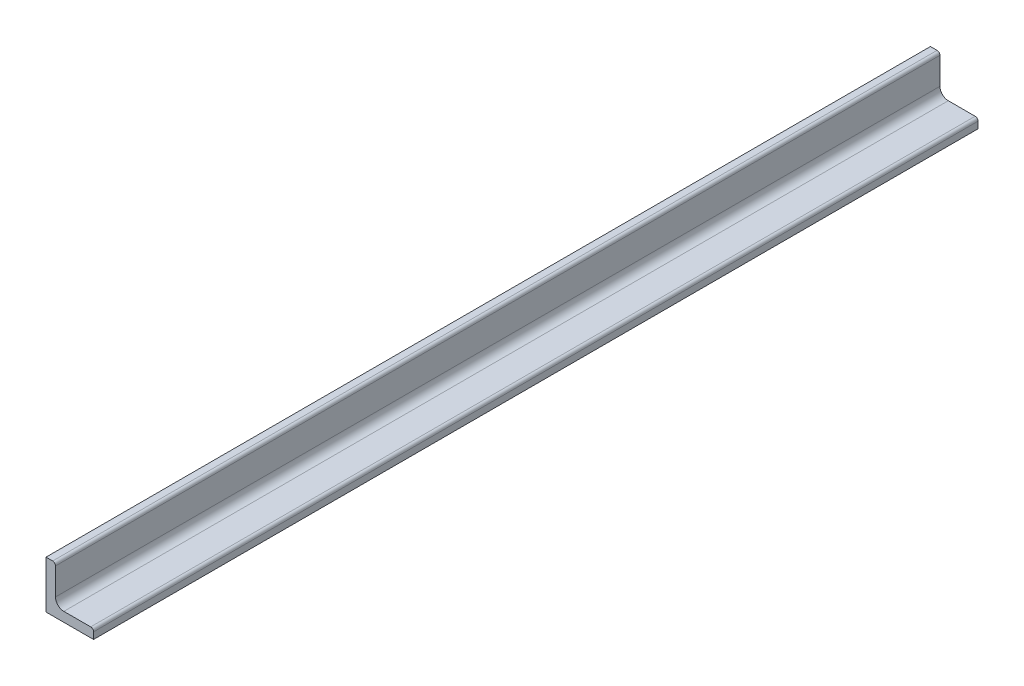
ISO-10303-21;
HEADER;
FILE_DESCRIPTION(('STEP AP214'),'2;1');
FILE_NAME('part.step','',(''),(''),'','','');
FILE_SCHEMA(('AUTOMOTIVE_DESIGN { 1 0 10303 214 1 1 1 1 }'));
ENDSEC;
DATA;
#1=APPLICATION_CONTEXT('core data for automotive mechanical design processes');
#2=APPLICATION_PROTOCOL_DEFINITION('international standard','automotive_design',2000,#1);
#3=PRODUCT_CONTEXT('',#1,'mechanical');
#4=PRODUCT('Part','Part','',(#3));
#5=PRODUCT_RELATED_PRODUCT_CATEGORY('part','',(#4));
#6=PRODUCT_DEFINITION_FORMATION('','',#4);
#7=PRODUCT_DEFINITION_CONTEXT('part definition',#1,'design');
#8=PRODUCT_DEFINITION('design','',#6,#7);
#9=PRODUCT_DEFINITION_SHAPE('','',#8);
#10=(LENGTH_UNIT() NAMED_UNIT(*) SI_UNIT(.MILLI.,.METRE.));
#11=(NAMED_UNIT(*) PLANE_ANGLE_UNIT() SI_UNIT($,.RADIAN.));
#12=(NAMED_UNIT(*) SI_UNIT($,.STERADIAN.) SOLID_ANGLE_UNIT());
#13=UNCERTAINTY_MEASURE_WITH_UNIT(LENGTH_MEASURE(1.E-05),#10,'distance_accuracy_value','');
#14=(GEOMETRIC_REPRESENTATION_CONTEXT(3) GLOBAL_UNCERTAINTY_ASSIGNED_CONTEXT((#13)) GLOBAL_UNIT_ASSIGNED_CONTEXT((#10,
#11,#12)) REPRESENTATION_CONTEXT('',''));
#15=CARTESIAN_POINT('',(0.,0.,0.));
#16=DIRECTION('',(0.,0.,1.));
#17=DIRECTION('',(1.,0.,0.));
#18=AXIS2_PLACEMENT_3D('',#15,#16,#17);
#19=CARTESIAN_POINT('',(-4.7,12.5,372.));
#20=DIRECTION('',(0.,-1.,0.));
#21=DIRECTION('',(0.,0.,-1.));
#22=AXIS2_PLACEMENT_3D('',#19,#20,#21);
#23=PLANE('',#22);
#24=DIRECTION('',(-1.,0.,0.));
#25=VECTOR('',#24,1.);
#26=CARTESIAN_POINT('',(-4.7,12.5,0.));
#27=LINE('',#26,#25);
#28=CARTESIAN_POINT('',(-4.7,12.5,0.));
#29=VERTEX_POINT('',#28);
#30=CARTESIAN_POINT('',(-7.5,12.5,0.));
#31=VERTEX_POINT('',#30);
#32=EDGE_CURVE('E137',#29,#31,#27,.T.);
#33=ORIENTED_EDGE('',*,*,#32,.T.);
#34=DIRECTION('',(0.,0.,-1.));
#35=VECTOR('',#34,1.);
#36=CARTESIAN_POINT('',(-7.5,12.5,372.));
#37=LINE('',#36,#35);
#38=CARTESIAN_POINT('',(-7.5,12.5,372.));
#39=VERTEX_POINT('',#38);
#40=EDGE_CURVE('E11',#39,#31,#37,.T.);
#41=ORIENTED_EDGE('',*,*,#40,.F.);
#42=DIRECTION('',(-1.,0.,0.));
#43=VECTOR('',#42,1.);
#44=CARTESIAN_POINT('',(-4.7,12.5,372.));
#45=LINE('',#44,#43);
#46=CARTESIAN_POINT('',(-4.7,12.5,372.));
#47=VERTEX_POINT('',#46);
#48=EDGE_CURVE('E153',#47,#39,#45,.T.);
#49=ORIENTED_EDGE('',*,*,#48,.F.);
#50=DIRECTION('',(0.,0.,-1.));
#51=VECTOR('',#50,1.);
#52=CARTESIAN_POINT('',(-4.7,12.5,372.));
#53=LINE('',#52,#51);
#54=EDGE_CURVE('E133',#47,#29,#53,.T.);
#55=ORIENTED_EDGE('',*,*,#54,.T.);
#56=EDGE_LOOP('',(#33,#41,#49,#55));
#57=FACE_BOUND('',#56,.T.);
#58=ADVANCED_FACE('F35',(#57),#23,.F.);
#59=CARTESIAN_POINT('',(-7.5,12.5,372.));
#60=DIRECTION('',(1.,0.,0.));
#61=DIRECTION('',(0.,1.,0.));
#62=AXIS2_PLACEMENT_3D('',#59,#60,#61);
#63=PLANE('',#62);
#64=DIRECTION('',(0.,-1.,0.));
#65=VECTOR('',#64,1.);
#66=CARTESIAN_POINT('',(-7.5,12.5,0.));
#67=LINE('',#66,#65);
#68=CARTESIAN_POINT('',(-7.49999999999999,-7.49999999999999,0.));
#69=VERTEX_POINT('',#68);
#70=EDGE_CURVE('E140',#31,#69,#67,.T.);
#71=ORIENTED_EDGE('',*,*,#70,.T.);
#72=DIRECTION('',(0.,0.,-1.));
#73=VECTOR('',#72,1.);
#74=CARTESIAN_POINT('',(-7.49999999999999,-7.49999999999999,372.));
#75=LINE('',#74,#73);
#76=CARTESIAN_POINT('',(-7.49999999999999,-7.49999999999999,372.));
#77=VERTEX_POINT('',#76);
#78=EDGE_CURVE('E43',#77,#69,#75,.T.);
#79=ORIENTED_EDGE('',*,*,#78,.F.);
#80=DIRECTION('',(0.,-1.,0.));
#81=VECTOR('',#80,1.);
#82=CARTESIAN_POINT('',(-7.5,12.5,372.));
#83=LINE('',#82,#81);
#84=EDGE_CURVE('E97',#39,#77,#83,.T.);
#85=ORIENTED_EDGE('',*,*,#84,.F.);
#86=ORIENTED_EDGE('',*,*,#40,.T.);
#87=EDGE_LOOP('',(#71,#79,#85,#86));
#88=FACE_BOUND('',#87,.T.);
#89=ADVANCED_FACE('F196',(#88),#63,.F.);
#90=CARTESIAN_POINT('',(-7.49999999999999,-7.49999999999999,372.));
#91=DIRECTION('',(0.,1.,0.));
#92=DIRECTION('',(-1.,0.,0.));
#93=AXIS2_PLACEMENT_3D('',#90,#91,#92);
#94=PLANE('',#93);
#95=DIRECTION('',(1.,0.,0.));
#96=VECTOR('',#95,1.);
#97=CARTESIAN_POINT('',(-7.49999999999999,-7.49999999999999,0.));
#98=LINE('',#97,#96);
#99=CARTESIAN_POINT('',(12.5,-7.5,0.));
#100=VERTEX_POINT('',#99);
#101=EDGE_CURVE('E142',#69,#100,#98,.T.);
#102=ORIENTED_EDGE('',*,*,#101,.T.);
#103=DIRECTION('',(0.,0.,-1.));
#104=VECTOR('',#103,1.);
#105=CARTESIAN_POINT('',(12.5,-7.5,372.));
#106=LINE('',#105,#104);
#107=CARTESIAN_POINT('',(12.5,-7.5,372.));
#108=VERTEX_POINT('',#107);
#109=EDGE_CURVE('E163',#108,#100,#106,.T.);
#110=ORIENTED_EDGE('',*,*,#109,.F.);
#111=DIRECTION('',(1.,0.,0.));
#112=VECTOR('',#111,1.);
#113=CARTESIAN_POINT('',(-7.49999999999999,-7.49999999999999,372.));
#114=LINE('',#113,#112);
#115=EDGE_CURVE('E171',#77,#108,#114,.T.);
#116=ORIENTED_EDGE('',*,*,#115,.F.);
#117=ORIENTED_EDGE('',*,*,#78,.T.);
#118=EDGE_LOOP('',(#102,#110,#116,#117));
#119=FACE_BOUND('',#118,.T.);
#120=ADVANCED_FACE('F169',(#119),#94,.F.);
#121=CARTESIAN_POINT('',(12.5,-7.5,372.));
#122=DIRECTION('',(-1.,0.,0.));
#123=DIRECTION('',(0.,-1.,0.));
#124=AXIS2_PLACEMENT_3D('',#121,#122,#123);
#125=PLANE('',#124);
#126=DIRECTION('',(0.,1.,0.));
#127=VECTOR('',#126,1.);
#128=CARTESIAN_POINT('',(12.5,-7.5,0.));
#129=LINE('',#128,#127);
#130=CARTESIAN_POINT('',(12.5,-4.7,0.));
#131=VERTEX_POINT('',#130);
#132=EDGE_CURVE('E144',#100,#131,#129,.T.);
#133=ORIENTED_EDGE('',*,*,#132,.T.);
#134=DIRECTION('',(0.,0.,-1.));
#135=VECTOR('',#134,1.);
#136=CARTESIAN_POINT('',(12.5,-4.7,372.));
#137=LINE('',#136,#135);
#138=CARTESIAN_POINT('',(12.5,-4.7,372.));
#139=VERTEX_POINT('',#138);
#140=EDGE_CURVE('E160',#139,#131,#137,.T.);
#141=ORIENTED_EDGE('',*,*,#140,.F.);
#142=DIRECTION('',(0.,1.,0.));
#143=VECTOR('',#142,1.);
#144=CARTESIAN_POINT('',(12.5,-7.5,372.));
#145=LINE('',#144,#143);
#146=EDGE_CURVE('E187',#108,#139,#145,.T.);
#147=ORIENTED_EDGE('',*,*,#146,.F.);
#148=ORIENTED_EDGE('',*,*,#109,.T.);
#149=EDGE_LOOP('',(#133,#141,#147,#148));
#150=FACE_BOUND('',#149,.T.);
#151=ADVANCED_FACE('F180',(#150),#125,.F.);
#152=CARTESIAN_POINT('',(11.3,-4.7,372.));
#153=DIRECTION('',(0.,0.,-1.));
#154=DIRECTION('',(-1.,0.,0.));
#155=AXIS2_PLACEMENT_3D('',#152,#153,#154);
#156=CYLINDRICAL_SURFACE('',#155,1.2);
#157=CARTESIAN_POINT('',(11.3,-4.7,0.));
#158=DIRECTION('',(0.,0.,1.));
#159=DIRECTION('',(1.,0.,0.));
#160=AXIS2_PLACEMENT_3D('',#157,#158,#159);
#161=CIRCLE('',#160,1.2);
#162=CARTESIAN_POINT('',(11.3,-3.5,0.));
#163=VERTEX_POINT('',#162);
#164=EDGE_CURVE('E146',#131,#163,#161,.T.);
#165=ORIENTED_EDGE('',*,*,#164,.T.);
#166=DIRECTION('',(0.,0.,-1.));
#167=VECTOR('',#166,1.);
#168=CARTESIAN_POINT('',(11.3,-3.5,372.));
#169=LINE('',#168,#167);
#170=CARTESIAN_POINT('',(11.3,-3.5,372.));
#171=VERTEX_POINT('',#170);
#172=EDGE_CURVE('E157',#171,#163,#169,.T.);
#173=ORIENTED_EDGE('',*,*,#172,.F.);
#174=CARTESIAN_POINT('',(11.3,-4.7,372.));
#175=DIRECTION('',(0.,0.,1.));
#176=DIRECTION('',(1.,0.,0.));
#177=AXIS2_PLACEMENT_3D('',#174,#175,#176);
#178=CIRCLE('',#177,1.2);
#179=EDGE_CURVE('E186',#139,#171,#178,.T.);
#180=ORIENTED_EDGE('',*,*,#179,.F.);
#181=ORIENTED_EDGE('',*,*,#140,.T.);
#182=EDGE_LOOP('',(#165,#173,#180,#181));
#183=FACE_BOUND('',#182,.T.);
#184=ADVANCED_FACE('F184',(#183),#156,.T.);
#185=CARTESIAN_POINT('',(11.3,-3.5,372.));
#186=DIRECTION('',(0.,-1.,0.));
#187=DIRECTION('',(0.,0.,-1.));
#188=AXIS2_PLACEMENT_3D('',#185,#186,#187);
#189=PLANE('',#188);
#190=DIRECTION('',(-1.,0.,0.));
#191=VECTOR('',#190,1.);
#192=CARTESIAN_POINT('',(11.3,-3.5,0.));
#193=LINE('',#192,#191);
#194=CARTESIAN_POINT('',(0.,-3.5,0.));
#195=VERTEX_POINT('',#194);
#196=EDGE_CURVE('E148',#163,#195,#193,.T.);
#197=ORIENTED_EDGE('',*,*,#196,.T.);
#198=DIRECTION('',(0.,0.,-1.));
#199=VECTOR('',#198,1.);
#200=CARTESIAN_POINT('',(0.,-3.5,372.));
#201=LINE('',#200,#199);
#202=CARTESIAN_POINT('',(0.,-3.5,372.));
#203=VERTEX_POINT('',#202);
#204=EDGE_CURVE('E128',#203,#195,#201,.T.);
#205=ORIENTED_EDGE('',*,*,#204,.F.);
#206=DIRECTION('',(-1.,0.,0.));
#207=VECTOR('',#206,1.);
#208=CARTESIAN_POINT('',(11.3,-3.5,372.));
#209=LINE('',#208,#207);
#210=EDGE_CURVE('E119',#171,#203,#209,.T.);
#211=ORIENTED_EDGE('',*,*,#210,.F.);
#212=ORIENTED_EDGE('',*,*,#172,.T.);
#213=EDGE_LOOP('',(#197,#205,#211,#212));
#214=FACE_BOUND('',#213,.T.);
#215=ADVANCED_FACE('F208',(#214),#189,.F.);
#216=CARTESIAN_POINT('',(0.,0.,372.));
#217=DIRECTION('',(0.,0.,-1.));
#218=DIRECTION('',(-1.,0.,0.));
#219=AXIS2_PLACEMENT_3D('',#216,#217,#218);
#220=CYLINDRICAL_SURFACE('',#219,3.5);
#221=CARTESIAN_POINT('',(0.,0.,0.));
#222=DIRECTION('',(0.,0.,-1.));
#223=DIRECTION('',(1.,0.,0.));
#224=AXIS2_PLACEMENT_3D('',#221,#222,#223);
#225=CIRCLE('',#224,3.5);
#226=CARTESIAN_POINT('',(-3.5,0.,0.));
#227=VERTEX_POINT('',#226);
#228=EDGE_CURVE('E127',#195,#227,#225,.T.);
#229=ORIENTED_EDGE('',*,*,#228,.T.);
#230=DIRECTION('',(0.,0.,-1.));
#231=VECTOR('',#230,1.);
#232=CARTESIAN_POINT('',(-3.5,0.,372.));
#233=LINE('',#232,#231);
#234=CARTESIAN_POINT('',(-3.5,0.,372.));
#235=VERTEX_POINT('',#234);
#236=EDGE_CURVE('E124',#235,#227,#233,.T.);
#237=ORIENTED_EDGE('',*,*,#236,.F.);
#238=CARTESIAN_POINT('',(0.,0.,372.));
#239=DIRECTION('',(0.,0.,-1.));
#240=DIRECTION('',(1.,0.,0.));
#241=AXIS2_PLACEMENT_3D('',#238,#239,#240);
#242=CIRCLE('',#241,3.5);
#243=EDGE_CURVE('E113',#203,#235,#242,.T.);
#244=ORIENTED_EDGE('',*,*,#243,.F.);
#245=ORIENTED_EDGE('',*,*,#204,.T.);
#246=EDGE_LOOP('',(#229,#237,#244,#245));
#247=FACE_BOUND('',#246,.T.);
#248=ADVANCED_FACE('F125',(#247),#220,.F.);
#249=CARTESIAN_POINT('',(-3.5,0.,372.));
#250=DIRECTION('',(-1.,0.,0.));
#251=DIRECTION('',(0.,0.,1.));
#252=AXIS2_PLACEMENT_3D('',#249,#250,#251);
#253=PLANE('',#252);
#254=DIRECTION('',(0.,1.,0.));
#255=VECTOR('',#254,1.);
#256=CARTESIAN_POINT('',(-3.5,0.,0.));
#257=LINE('',#256,#255);
#258=CARTESIAN_POINT('',(-3.5,11.3,0.));
#259=VERTEX_POINT('',#258);
#260=EDGE_CURVE('E83',#227,#259,#257,.T.);
#261=ORIENTED_EDGE('',*,*,#260,.T.);
#262=DIRECTION('',(0.,0.,-1.));
#263=VECTOR('',#262,1.);
#264=CARTESIAN_POINT('',(-3.5,11.3,372.));
#265=LINE('',#264,#263);
#266=CARTESIAN_POINT('',(-3.5,11.3,372.));
#267=VERTEX_POINT('',#266);
#268=EDGE_CURVE('E129',#267,#259,#265,.T.);
#269=ORIENTED_EDGE('',*,*,#268,.F.);
#270=DIRECTION('',(0.,1.,0.));
#271=VECTOR('',#270,1.);
#272=CARTESIAN_POINT('',(-3.5,0.,372.));
#273=LINE('',#272,#271);
#274=EDGE_CURVE('E117',#235,#267,#273,.T.);
#275=ORIENTED_EDGE('',*,*,#274,.F.);
#276=ORIENTED_EDGE('',*,*,#236,.T.);
#277=EDGE_LOOP('',(#261,#269,#275,#276));
#278=FACE_BOUND('',#277,.T.);
#279=ADVANCED_FACE('F131',(#278),#253,.F.);
#280=CARTESIAN_POINT('',(-4.7,11.3,372.));
#281=DIRECTION('',(0.,0.,-1.));
#282=DIRECTION('',(-1.,0.,0.));
#283=AXIS2_PLACEMENT_3D('',#280,#281,#282);
#284=CYLINDRICAL_SURFACE('',#283,1.2);
#285=CARTESIAN_POINT('',(-4.7,11.3,0.));
#286=DIRECTION('',(0.,0.,1.));
#287=DIRECTION('',(1.,0.,0.));
#288=AXIS2_PLACEMENT_3D('',#285,#286,#287);
#289=CIRCLE('',#288,1.2);
#290=EDGE_CURVE('E89',#259,#29,#289,.T.);
#291=ORIENTED_EDGE('',*,*,#290,.T.);
#292=ORIENTED_EDGE('',*,*,#54,.F.);
#293=CARTESIAN_POINT('',(-4.7,11.3,372.));
#294=DIRECTION('',(0.,0.,1.));
#295=DIRECTION('',(1.,0.,0.));
#296=AXIS2_PLACEMENT_3D('',#293,#294,#295);
#297=CIRCLE('',#296,1.2);
#298=EDGE_CURVE('E51',#267,#47,#297,.T.);
#299=ORIENTED_EDGE('',*,*,#298,.F.);
#300=ORIENTED_EDGE('',*,*,#268,.T.);
#301=EDGE_LOOP('',(#291,#292,#299,#300));
#302=FACE_BOUND('',#301,.T.);
#303=ADVANCED_FACE('F216',(#302),#284,.T.);
#304=CARTESIAN_POINT('',(11.3,-4.7,372.));
#305=DIRECTION('',(0.,0.,1.));
#306=DIRECTION('',(1.,0.,0.));
#307=AXIS2_PLACEMENT_3D('',#304,#305,#306);
#308=PLANE('',#307);
#309=ORIENTED_EDGE('',*,*,#48,.T.);
#310=ORIENTED_EDGE('',*,*,#84,.T.);
#311=ORIENTED_EDGE('',*,*,#115,.T.);
#312=ORIENTED_EDGE('',*,*,#146,.T.);
#313=ORIENTED_EDGE('',*,*,#179,.T.);
#314=ORIENTED_EDGE('',*,*,#210,.T.);
#315=ORIENTED_EDGE('',*,*,#243,.T.);
#316=ORIENTED_EDGE('',*,*,#274,.T.);
#317=ORIENTED_EDGE('',*,*,#298,.T.);
#318=EDGE_LOOP('',(#309,#310,#311,#312,#313,#314,#315,#316,#317));
#319=FACE_BOUND('',#318,.T.);
#320=ADVANCED_FACE('F115',(#319),#308,.T.);
#321=CARTESIAN_POINT('',(11.3,-4.7,0.));
#322=DIRECTION('',(0.,0.,1.));
#323=DIRECTION('',(1.,0.,0.));
#324=AXIS2_PLACEMENT_3D('',#321,#322,#323);
#325=PLANE('',#324);
#326=ORIENTED_EDGE('',*,*,#32,.F.);
#327=ORIENTED_EDGE('',*,*,#290,.F.);
#328=ORIENTED_EDGE('',*,*,#260,.F.);
#329=ORIENTED_EDGE('',*,*,#228,.F.);
#330=ORIENTED_EDGE('',*,*,#196,.F.);
#331=ORIENTED_EDGE('',*,*,#164,.F.);
#332=ORIENTED_EDGE('',*,*,#132,.F.);
#333=ORIENTED_EDGE('',*,*,#101,.F.);
#334=ORIENTED_EDGE('',*,*,#70,.F.);
#335=EDGE_LOOP('',(#326,#327,#328,#329,#330,#331,#332,#333,#334));
#336=FACE_BOUND('',#335,.T.);
#337=ADVANCED_FACE('F175',(#336),#325,.F.);
#338=CLOSED_SHELL('',(#58,#89,#120,#151,#184,#215,#248,#279,#303,#320,#337));
#339=MANIFOLD_SOLID_BREP('B2',#338);
#340=ADVANCED_BREP_SHAPE_REPRESENTATION('',(#18,#339),#14);
#341=SHAPE_DEFINITION_REPRESENTATION(#9,#340);
ENDSEC;
END-ISO-10303-21;
